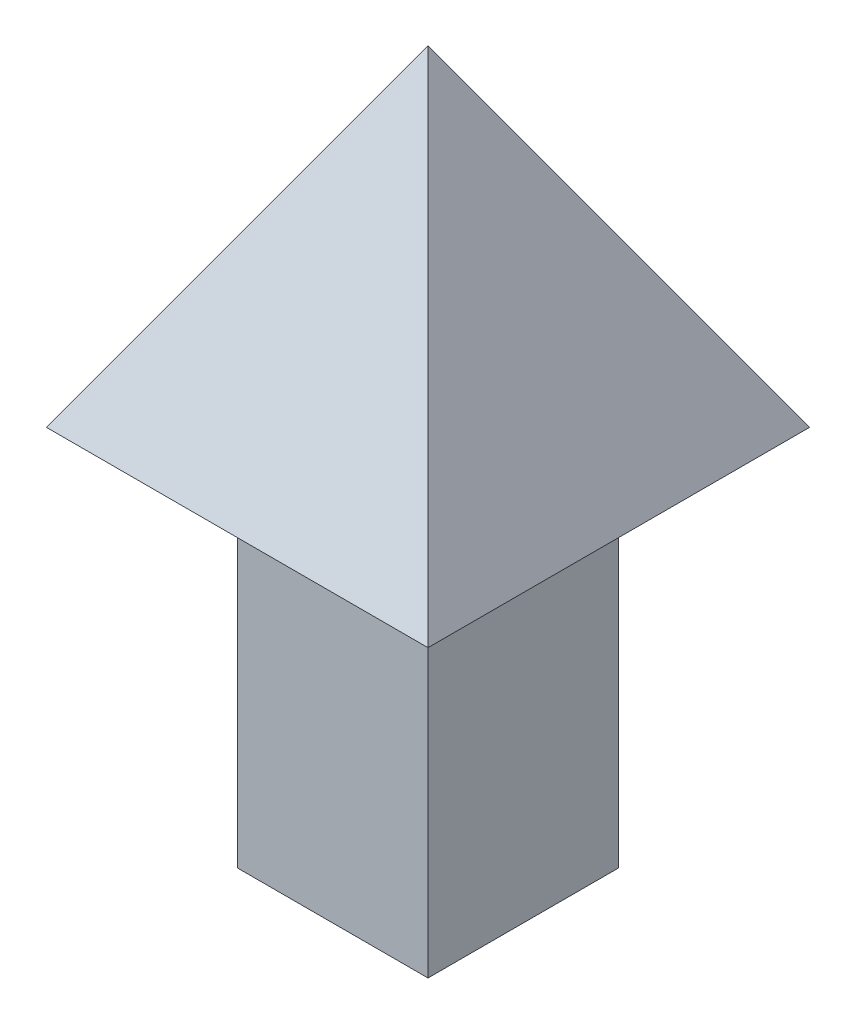
ISO-10303-21;
HEADER;
FILE_DESCRIPTION(('STEP AP214'),'2;1');
FILE_NAME('part.step','',(''),(''),'','','');
FILE_SCHEMA(('AUTOMOTIVE_DESIGN { 1 0 10303 214 1 1 1 1 }'));
ENDSEC;
DATA;
#1=APPLICATION_CONTEXT('core data for automotive mechanical design processes');
#2=APPLICATION_PROTOCOL_DEFINITION('international standard','automotive_design',2000,#1);
#3=PRODUCT_CONTEXT('',#1,'mechanical');
#4=PRODUCT('Part','Part','',(#3));
#5=PRODUCT_RELATED_PRODUCT_CATEGORY('part','',(#4));
#6=PRODUCT_DEFINITION_FORMATION('','',#4);
#7=PRODUCT_DEFINITION_CONTEXT('part definition',#1,'design');
#8=PRODUCT_DEFINITION('design','',#6,#7);
#9=PRODUCT_DEFINITION_SHAPE('','',#8);
#10=(LENGTH_UNIT() NAMED_UNIT(*) SI_UNIT(.MILLI.,.METRE.));
#11=(NAMED_UNIT(*) PLANE_ANGLE_UNIT() SI_UNIT($,.RADIAN.));
#12=(NAMED_UNIT(*) SI_UNIT($,.STERADIAN.) SOLID_ANGLE_UNIT());
#13=UNCERTAINTY_MEASURE_WITH_UNIT(LENGTH_MEASURE(1.E-05),#10,'distance_accuracy_value','');
#14=(GEOMETRIC_REPRESENTATION_CONTEXT(3) GLOBAL_UNCERTAINTY_ASSIGNED_CONTEXT((#13)) GLOBAL_UNIT_ASSIGNED_CONTEXT((#10,
#11,#12)) REPRESENTATION_CONTEXT('',''));
#15=CARTESIAN_POINT('',(0.,0.,0.));
#16=DIRECTION('',(0.,0.,1.));
#17=DIRECTION('',(1.,0.,0.));
#18=AXIS2_PLACEMENT_3D('',#15,#16,#17);
#19=CARTESIAN_POINT('',(-500.,2000.,500.));
#20=DIRECTION('',(1.,0.,0.));
#21=DIRECTION('',(0.,0.,-1.));
#22=AXIS2_PLACEMENT_3D('',#19,#20,#21);
#23=PLANE('',#22);
#24=DIRECTION('',(0.,0.,1.));
#25=VECTOR('',#24,1.);
#26=CARTESIAN_POINT('',(-500.,0.,500.));
#27=LINE('',#26,#25);
#28=CARTESIAN_POINT('',(-500.,0.,-500.));
#29=VERTEX_POINT('',#28);
#30=CARTESIAN_POINT('',(-500.,0.,500.));
#31=VERTEX_POINT('',#30);
#32=EDGE_CURVE('E114',#29,#31,#27,.T.);
#33=ORIENTED_EDGE('',*,*,#32,.T.);
#34=DIRECTION('',(0.,-1.,0.));
#35=VECTOR('',#34,1.);
#36=CARTESIAN_POINT('',(-500.,2000.,500.));
#37=LINE('',#36,#35);
#38=CARTESIAN_POINT('',(-500.,2000.,500.));
#39=VERTEX_POINT('',#38);
#40=EDGE_CURVE('E11',#39,#31,#37,.T.);
#41=ORIENTED_EDGE('',*,*,#40,.F.);
#42=DIRECTION('',(0.,0.,1.));
#43=VECTOR('',#42,1.);
#44=CARTESIAN_POINT('',(-500.,2000.,500.));
#45=LINE('',#44,#43);
#46=CARTESIAN_POINT('',(-500.,2000.,-500.));
#47=VERTEX_POINT('',#46);
#48=EDGE_CURVE('E129',#47,#39,#45,.T.);
#49=ORIENTED_EDGE('',*,*,#48,.F.);
#50=DIRECTION('',(0.,-1.,0.));
#51=VECTOR('',#50,1.);
#52=CARTESIAN_POINT('',(-500.,2000.,-500.));
#53=LINE('',#52,#51);
#54=EDGE_CURVE('E139',#47,#29,#53,.T.);
#55=ORIENTED_EDGE('',*,*,#54,.T.);
#56=EDGE_LOOP('',(#33,#41,#49,#55));
#57=FACE_BOUND('',#56,.T.);
#58=ADVANCED_FACE('F33',(#57),#23,.F.);
#59=CARTESIAN_POINT('',(-500.,2000.,500.));
#60=DIRECTION('',(0.,0.,-1.));
#61=DIRECTION('',(-1.,0.,0.));
#62=AXIS2_PLACEMENT_3D('',#59,#60,#61);
#63=PLANE('',#62);
#64=DIRECTION('',(1.,0.,0.));
#65=VECTOR('',#64,1.);
#66=CARTESIAN_POINT('',(-500.,0.,500.));
#67=LINE('',#66,#65);
#68=CARTESIAN_POINT('',(500.,0.,500.));
#69=VERTEX_POINT('',#68);
#70=EDGE_CURVE('E142',#31,#69,#67,.T.);
#71=ORIENTED_EDGE('',*,*,#70,.T.);
#72=DIRECTION('',(0.,-1.,0.));
#73=VECTOR('',#72,1.);
#74=CARTESIAN_POINT('',(500.,2000.,500.));
#75=LINE('',#74,#73);
#76=CARTESIAN_POINT('',(500.,2000.,500.));
#77=VERTEX_POINT('',#76);
#78=EDGE_CURVE('E41',#77,#69,#75,.T.);
#79=ORIENTED_EDGE('',*,*,#78,.F.);
#80=DIRECTION('',(1.,0.,0.));
#81=VECTOR('',#80,1.);
#82=CARTESIAN_POINT('',(-500.,2000.,500.));
#83=LINE('',#82,#81);
#84=EDGE_CURVE('E75',#39,#77,#83,.T.);
#85=ORIENTED_EDGE('',*,*,#84,.F.);
#86=ORIENTED_EDGE('',*,*,#40,.T.);
#87=EDGE_LOOP('',(#71,#79,#85,#86));
#88=FACE_BOUND('',#87,.T.);
#89=ADVANCED_FACE('F165',(#88),#63,.F.);
#90=CARTESIAN_POINT('',(500.,2000.,500.));
#91=DIRECTION('',(-1.,0.,0.));
#92=DIRECTION('',(0.,0.,1.));
#93=AXIS2_PLACEMENT_3D('',#90,#91,#92);
#94=PLANE('',#93);
#95=DIRECTION('',(0.,0.,-1.));
#96=VECTOR('',#95,1.);
#97=CARTESIAN_POINT('',(500.,0.,500.));
#98=LINE('',#97,#96);
#99=CARTESIAN_POINT('',(500.,0.,-500.));
#100=VERTEX_POINT('',#99);
#101=EDGE_CURVE('E65',#69,#100,#98,.T.);
#102=ORIENTED_EDGE('',*,*,#101,.T.);
#103=DIRECTION('',(0.,-1.,0.));
#104=VECTOR('',#103,1.);
#105=CARTESIAN_POINT('',(500.,2000.,-500.));
#106=LINE('',#105,#104);
#107=CARTESIAN_POINT('',(500.,2000.,-500.));
#108=VERTEX_POINT('',#107);
#109=EDGE_CURVE('E49',#108,#100,#106,.T.);
#110=ORIENTED_EDGE('',*,*,#109,.F.);
#111=DIRECTION('',(0.,0.,-1.));
#112=VECTOR('',#111,1.);
#113=CARTESIAN_POINT('',(500.,2000.,500.));
#114=LINE('',#113,#112);
#115=EDGE_CURVE('E133',#77,#108,#114,.T.);
#116=ORIENTED_EDGE('',*,*,#115,.F.);
#117=ORIENTED_EDGE('',*,*,#78,.T.);
#118=EDGE_LOOP('',(#102,#110,#116,#117));
#119=FACE_BOUND('',#118,.T.);
#120=ADVANCED_FACE('F147',(#119),#94,.F.);
#121=CARTESIAN_POINT('',(-500.,2000.,-500.));
#122=DIRECTION('',(0.,0.,1.));
#123=DIRECTION('',(1.,0.,0.));
#124=AXIS2_PLACEMENT_3D('',#121,#122,#123);
#125=PLANE('',#124);
#126=DIRECTION('',(-1.,0.,0.));
#127=VECTOR('',#126,1.);
#128=CARTESIAN_POINT('',(-500.,0.,-500.));
#129=LINE('',#128,#127);
#130=EDGE_CURVE('E70',#100,#29,#129,.T.);
#131=ORIENTED_EDGE('',*,*,#130,.T.);
#132=ORIENTED_EDGE('',*,*,#54,.F.);
#133=DIRECTION('',(-1.,0.,0.));
#134=VECTOR('',#133,1.);
#135=CARTESIAN_POINT('',(-500.,2000.,-500.));
#136=LINE('',#135,#134);
#137=EDGE_CURVE('E136',#108,#47,#136,.T.);
#138=ORIENTED_EDGE('',*,*,#137,.F.);
#139=ORIENTED_EDGE('',*,*,#109,.T.);
#140=EDGE_LOOP('',(#131,#132,#138,#139));
#141=FACE_BOUND('',#140,.T.);
#142=ADVANCED_FACE('F152',(#141),#125,.F.);
#143=CARTESIAN_POINT('',(0.,0.,0.));
#144=DIRECTION('',(0.,-1.,0.));
#145=DIRECTION('',(0.,0.,-1.));
#146=AXIS2_PLACEMENT_3D('',#143,#144,#145);
#147=PLANE('',#146);
#148=ORIENTED_EDGE('',*,*,#32,.F.);
#149=ORIENTED_EDGE('',*,*,#130,.F.);
#150=ORIENTED_EDGE('',*,*,#101,.F.);
#151=ORIENTED_EDGE('',*,*,#70,.F.);
#152=EDGE_LOOP('',(#148,#149,#150,#151));
#153=FACE_BOUND('',#152,.T.);
#154=ADVANCED_FACE('F150',(#153),#147,.T.);
#155=CARTESIAN_POINT('',(-1000.,2000.,1000.));
#156=DIRECTION('',(-0.866025403784438,0.500000000000001,0.));
#157=DIRECTION('',(-0.500000000000001,-0.866025403784438,0.));
#158=AXIS2_PLACEMENT_3D('',#155,#156,#157);
#159=PLANE('',#158);
#160=DIRECTION('',(0.,0.,1.));
#161=VECTOR('',#160,1.);
#162=CARTESIAN_POINT('',(-1000.,2000.,1000.));
#163=LINE('',#162,#161);
#164=CARTESIAN_POINT('',(-1000.,2000.,-1000.));
#165=VERTEX_POINT('',#164);
#166=CARTESIAN_POINT('',(-1000.,2000.,1000.));
#167=VERTEX_POINT('',#166);
#168=EDGE_CURVE('E103',#165,#167,#163,.T.);
#169=ORIENTED_EDGE('',*,*,#168,.T.);
#170=DIRECTION('',(-0.447213595499959,-0.774596669241482,0.447213595499959));
#171=VECTOR('',#170,1.);
#172=CARTESIAN_POINT('',(-1000.,2000.,1000.));
#173=LINE('',#172,#171);
#174=CARTESIAN_POINT('',(2.22044604925031E-13,3732.05080756887,1.11022302462516E-13));
#175=VERTEX_POINT('',#174);
#176=EDGE_CURVE('E109',#175,#167,#173,.T.);
#177=ORIENTED_EDGE('',*,*,#176,.F.);
#178=DIRECTION('',(-0.447213595499959,-0.774596669241482,-0.447213595499959));
#179=VECTOR('',#178,1.);
#180=CARTESIAN_POINT('',(-599.999999999999,2692.82032302755,-599.999999999999));
#181=LINE('',#180,#179);
#182=EDGE_CURVE('E118',#175,#165,#181,.T.);
#183=ORIENTED_EDGE('',*,*,#182,.T.);
#184=EDGE_LOOP('',(#169,#177,#183));
#185=FACE_BOUND('',#184,.T.);
#186=ADVANCED_FACE('F116',(#185),#159,.T.);
#187=CARTESIAN_POINT('',(-1000.,2000.,1000.));
#188=DIRECTION('',(0.,0.500000000000001,0.866025403784438));
#189=DIRECTION('',(0.,-0.866025403784438,0.500000000000001));
#190=AXIS2_PLACEMENT_3D('',#187,#188,#189);
#191=PLANE('',#190);
#192=DIRECTION('',(1.,0.,0.));
#193=VECTOR('',#192,1.);
#194=CARTESIAN_POINT('',(-1000.,2000.,1000.));
#195=LINE('',#194,#193);
#196=CARTESIAN_POINT('',(1000.,2000.,1000.));
#197=VERTEX_POINT('',#196);
#198=EDGE_CURVE('E98',#167,#197,#195,.T.);
#199=ORIENTED_EDGE('',*,*,#198,.T.);
#200=DIRECTION('',(0.447213595499959,-0.774596669241482,0.447213595499959));
#201=VECTOR('',#200,1.);
#202=CARTESIAN_POINT('',(1000.,2000.,1000.));
#203=LINE('',#202,#201);
#204=EDGE_CURVE('E111',#175,#197,#203,.T.);
#205=ORIENTED_EDGE('',*,*,#204,.F.);
#206=ORIENTED_EDGE('',*,*,#176,.T.);
#207=EDGE_LOOP('',(#199,#205,#206));
#208=FACE_BOUND('',#207,.T.);
#209=ADVANCED_FACE('F110',(#208),#191,.T.);
#210=CARTESIAN_POINT('',(1000.,2000.,1000.));
#211=DIRECTION('',(0.866025403784438,0.500000000000001,0.));
#212=DIRECTION('',(-0.500000000000001,0.866025403784438,0.));
#213=AXIS2_PLACEMENT_3D('',#210,#211,#212);
#214=PLANE('',#213);
#215=DIRECTION('',(0.,0.,-1.));
#216=VECTOR('',#215,1.);
#217=CARTESIAN_POINT('',(1000.,2000.,1000.));
#218=LINE('',#217,#216);
#219=CARTESIAN_POINT('',(1000.,2000.,-1000.));
#220=VERTEX_POINT('',#219);
#221=EDGE_CURVE('E105',#197,#220,#218,.T.);
#222=ORIENTED_EDGE('',*,*,#221,.T.);
#223=DIRECTION('',(0.447213595499959,-0.774596669241482,-0.447213595499959));
#224=VECTOR('',#223,1.);
#225=CARTESIAN_POINT('',(599.999999999999,2692.82032302755,-599.999999999999));
#226=LINE('',#225,#224);
#227=EDGE_CURVE('E126',#175,#220,#226,.T.);
#228=ORIENTED_EDGE('',*,*,#227,.F.);
#229=ORIENTED_EDGE('',*,*,#204,.T.);
#230=EDGE_LOOP('',(#222,#228,#229));
#231=FACE_BOUND('',#230,.T.);
#232=ADVANCED_FACE('F160',(#231),#214,.T.);
#233=CARTESIAN_POINT('',(-1000.,2000.,-1000.));
#234=DIRECTION('',(0.,0.500000000000001,-0.866025403784438));
#235=DIRECTION('',(0.,0.866025403784438,0.500000000000001));
#236=AXIS2_PLACEMENT_3D('',#233,#234,#235);
#237=PLANE('',#236);
#238=DIRECTION('',(-1.,0.,0.));
#239=VECTOR('',#238,1.);
#240=CARTESIAN_POINT('',(-1000.,2000.,-1000.));
#241=LINE('',#240,#239);
#242=EDGE_CURVE('E123',#220,#165,#241,.T.);
#243=ORIENTED_EDGE('',*,*,#242,.T.);
#244=ORIENTED_EDGE('',*,*,#182,.F.);
#245=ORIENTED_EDGE('',*,*,#227,.T.);
#246=EDGE_LOOP('',(#243,#244,#245));
#247=FACE_BOUND('',#246,.T.);
#248=ADVANCED_FACE('F155',(#247),#237,.T.);
#249=CARTESIAN_POINT('',(0.,2000.,0.));
#250=DIRECTION('',(0.,-1.,0.));
#251=DIRECTION('',(0.,0.,-1.));
#252=AXIS2_PLACEMENT_3D('',#249,#250,#251);
#253=PLANE('',#252);
#254=ORIENTED_EDGE('',*,*,#137,.T.);
#255=ORIENTED_EDGE('',*,*,#48,.T.);
#256=ORIENTED_EDGE('',*,*,#84,.T.);
#257=ORIENTED_EDGE('',*,*,#115,.T.);
#258=EDGE_LOOP('',(#254,#255,#256,#257));
#259=FACE_BOUND('',#258,.T.);
#260=ORIENTED_EDGE('',*,*,#168,.F.);
#261=ORIENTED_EDGE('',*,*,#242,.F.);
#262=ORIENTED_EDGE('',*,*,#221,.F.);
#263=ORIENTED_EDGE('',*,*,#198,.F.);
#264=EDGE_LOOP('',(#260,#261,#262,#263));
#265=FACE_BOUND('',#264,.T.);
#266=ADVANCED_FACE('F100',(#259,#265),#253,.T.);
#267=CLOSED_SHELL('',(#58,#89,#120,#142,#154,#186,#209,#232,#248,#266));
#268=MANIFOLD_SOLID_BREP('B2',#267);
#269=ADVANCED_BREP_SHAPE_REPRESENTATION('',(#18,#268),#14);
#270=SHAPE_DEFINITION_REPRESENTATION(#9,#269);
ENDSEC;
END-ISO-10303-21;
